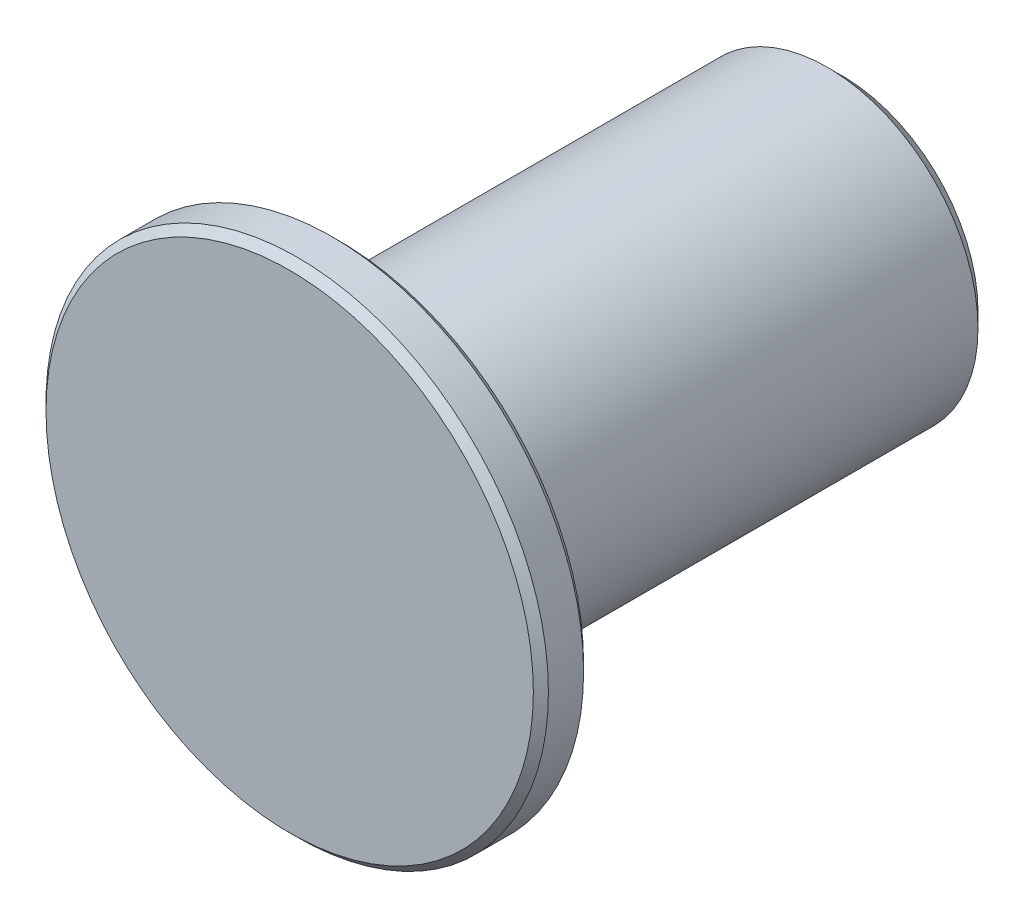
ISO-10303-21;
HEADER;
FILE_DESCRIPTION(('STEP AP214'),'2;1');
FILE_NAME('part.step','',(''),(''),'','','');
FILE_SCHEMA(('AUTOMOTIVE_DESIGN { 1 0 10303 214 1 1 1 1 }'));
ENDSEC;
DATA;
#1=APPLICATION_CONTEXT('core data for automotive mechanical design processes');
#2=APPLICATION_PROTOCOL_DEFINITION('international standard','automotive_design',2000,#1);
#3=PRODUCT_CONTEXT('',#1,'mechanical');
#4=PRODUCT('Part','Part','',(#3));
#5=PRODUCT_RELATED_PRODUCT_CATEGORY('part','',(#4));
#6=PRODUCT_DEFINITION_FORMATION('','',#4);
#7=PRODUCT_DEFINITION_CONTEXT('part definition',#1,'design');
#8=PRODUCT_DEFINITION('design','',#6,#7);
#9=PRODUCT_DEFINITION_SHAPE('','',#8);
#10=(LENGTH_UNIT() NAMED_UNIT(*) SI_UNIT(.MILLI.,.METRE.));
#11=(NAMED_UNIT(*) PLANE_ANGLE_UNIT() SI_UNIT($,.RADIAN.));
#12=(NAMED_UNIT(*) SI_UNIT($,.STERADIAN.) SOLID_ANGLE_UNIT());
#13=UNCERTAINTY_MEASURE_WITH_UNIT(LENGTH_MEASURE(1.E-05),#10,'distance_accuracy_value','');
#14=(GEOMETRIC_REPRESENTATION_CONTEXT(3) GLOBAL_UNCERTAINTY_ASSIGNED_CONTEXT((#13)) GLOBAL_UNIT_ASSIGNED_CONTEXT((#10,
#11,#12)) REPRESENTATION_CONTEXT('',''));
#15=CARTESIAN_POINT('',(0.,0.,0.));
#16=DIRECTION('',(0.,0.,1.));
#17=DIRECTION('',(1.,0.,0.));
#18=AXIS2_PLACEMENT_3D('',#15,#16,#17);
#19=CARTESIAN_POINT('',(0.,0.,20.));
#20=DIRECTION('',(0.,0.,-1.));
#21=DIRECTION('',(-1.,0.,0.));
#22=AXIS2_PLACEMENT_3D('',#19,#20,#21);
#23=CYLINDRICAL_SURFACE('',#22,6.);
#24=CARTESIAN_POINT('',(0.,0.,0.600000000000007));
#25=DIRECTION('',(0.,0.,1.));
#26=DIRECTION('',(1.,0.,0.));
#27=AXIS2_PLACEMENT_3D('',#24,#25,#26);
#28=CIRCLE('',#27,6.);
#29=CARTESIAN_POINT('',(6.,0.,0.600000000000007));
#30=VERTEX_POINT('',#29);
#31=EDGE_CURVE('E65',#30,#30,#28,.T.);
#32=ORIENTED_EDGE('',*,*,#31,.T.);
#33=EDGE_LOOP('',(#32));
#34=FACE_BOUND('',#33,.T.);
#35=CARTESIAN_POINT('',(0.,0.,20.));
#36=DIRECTION('',(0.,0.,1.));
#37=DIRECTION('',(1.,0.,0.));
#38=AXIS2_PLACEMENT_3D('',#35,#36,#37);
#39=CIRCLE('',#38,6.);
#40=CARTESIAN_POINT('',(6.,0.,20.));
#41=VERTEX_POINT('',#40);
#42=EDGE_CURVE('E69',#41,#41,#39,.T.);
#43=ORIENTED_EDGE('',*,*,#42,.F.);
#44=EDGE_LOOP('',(#43));
#45=FACE_BOUND('',#44,.T.);
#46=ADVANCED_FACE('F37',(#34,#45),#23,.T.);
#47=CARTESIAN_POINT('',(0.,0.,0.));
#48=DIRECTION('',(0.,0.,1.));
#49=DIRECTION('',(1.,0.,0.));
#50=AXIS2_PLACEMENT_3D('',#47,#48,#49);
#51=PLANE('',#50);
#52=CARTESIAN_POINT('',(0.,0.,0.));
#53=DIRECTION('',(0.,0.,1.));
#54=DIRECTION('',(1.,0.,0.));
#55=AXIS2_PLACEMENT_3D('',#52,#53,#54);
#56=CIRCLE('',#55,5.39999999999999);
#57=CARTESIAN_POINT('',(5.39999999999999,0.,0.));
#58=VERTEX_POINT('',#57);
#59=EDGE_CURVE('E61',#58,#58,#56,.F.);
#60=ORIENTED_EDGE('',*,*,#59,.T.);
#61=EDGE_LOOP('',(#60));
#62=FACE_BOUND('',#61,.T.);
#63=ADVANCED_FACE('F77',(#62),#51,.F.);
#64=CARTESIAN_POINT('',(0.,0.,22.));
#65=DIRECTION('',(0.,0.,-1.));
#66=DIRECTION('',(-1.,0.,0.));
#67=AXIS2_PLACEMENT_3D('',#64,#65,#66);
#68=CYLINDRICAL_SURFACE('',#67,10.);
#69=CARTESIAN_POINT('',(0.,0.,20.3));
#70=DIRECTION('',(0.,0.,1.));
#71=DIRECTION('',(1.,0.,0.));
#72=AXIS2_PLACEMENT_3D('',#69,#70,#71);
#73=CIRCLE('',#72,10.);
#74=CARTESIAN_POINT('',(10.,0.,20.3));
#75=VERTEX_POINT('',#74);
#76=EDGE_CURVE('E50',#75,#75,#73,.T.);
#77=ORIENTED_EDGE('',*,*,#76,.T.);
#78=EDGE_LOOP('',(#77));
#79=FACE_BOUND('',#78,.T.);
#80=CARTESIAN_POINT('',(0.,0.,21.7));
#81=DIRECTION('',(0.,0.,1.));
#82=DIRECTION('',(1.,0.,0.));
#83=AXIS2_PLACEMENT_3D('',#80,#81,#82);
#84=CIRCLE('',#83,10.);
#85=CARTESIAN_POINT('',(10.,0.,21.7));
#86=VERTEX_POINT('',#85);
#87=EDGE_CURVE('E55',#86,#86,#84,.F.);
#88=ORIENTED_EDGE('',*,*,#87,.T.);
#89=EDGE_LOOP('',(#88));
#90=FACE_BOUND('',#89,.T.);
#91=ADVANCED_FACE('F83',(#79,#90),#68,.T.);
#92=CARTESIAN_POINT('',(0.,0.,22.));
#93=DIRECTION('',(0.,0.,1.));
#94=DIRECTION('',(1.,0.,0.));
#95=AXIS2_PLACEMENT_3D('',#92,#93,#94);
#96=PLANE('',#95);
#97=CARTESIAN_POINT('',(0.,0.,22.));
#98=DIRECTION('',(0.,0.,1.));
#99=DIRECTION('',(1.,0.,0.));
#100=AXIS2_PLACEMENT_3D('',#97,#98,#99);
#101=CIRCLE('',#100,9.7);
#102=CARTESIAN_POINT('',(9.7,0.,22.));
#103=VERTEX_POINT('',#102);
#104=EDGE_CURVE('E10',#103,#103,#101,.T.);
#105=ORIENTED_EDGE('',*,*,#104,.T.);
#106=EDGE_LOOP('',(#105));
#107=FACE_BOUND('',#106,.T.);
#108=ADVANCED_FACE('F103',(#107),#96,.T.);
#109=CARTESIAN_POINT('',(0.,0.,20.));
#110=DIRECTION('',(0.,0.,1.));
#111=DIRECTION('',(1.,0.,0.));
#112=AXIS2_PLACEMENT_3D('',#109,#110,#111);
#113=PLANE('',#112);
#114=CARTESIAN_POINT('',(0.,0.,20.));
#115=DIRECTION('',(0.,0.,1.));
#116=DIRECTION('',(1.,0.,0.));
#117=AXIS2_PLACEMENT_3D('',#114,#115,#116);
#118=CIRCLE('',#117,9.7);
#119=CARTESIAN_POINT('',(9.7,0.,20.));
#120=VERTEX_POINT('',#119);
#121=EDGE_CURVE('E45',#120,#120,#118,.F.);
#122=ORIENTED_EDGE('',*,*,#121,.T.);
#123=EDGE_LOOP('',(#122));
#124=FACE_BOUND('',#123,.T.);
#125=ORIENTED_EDGE('',*,*,#42,.T.);
#126=EDGE_LOOP('',(#125));
#127=FACE_BOUND('',#126,.T.);
#128=ADVANCED_FACE('F74',(#124,#127),#113,.F.);
#129=CARTESIAN_POINT('',(0.,0.,0.600000000000007));
#130=DIRECTION('',(0.,0.,1.));
#131=DIRECTION('',(1.,0.,0.));
#132=AXIS2_PLACEMENT_3D('',#129,#130,#131);
#133=CONICAL_SURFACE('',#132,6.,0.785398163397453);
#134=ORIENTED_EDGE('',*,*,#59,.F.);
#135=EDGE_LOOP('',(#134));
#136=FACE_BOUND('',#135,.T.);
#137=ORIENTED_EDGE('',*,*,#31,.F.);
#138=EDGE_LOOP('',(#137));
#139=FACE_BOUND('',#138,.T.);
#140=ADVANCED_FACE('F88',(#136,#139),#133,.T.);
#141=CARTESIAN_POINT('',(0.,0.,20.3));
#142=DIRECTION('',(0.,0.,1.));
#143=DIRECTION('',(1.,0.,0.));
#144=AXIS2_PLACEMENT_3D('',#141,#142,#143);
#145=CONICAL_SURFACE('',#144,10.,0.78539816339744);
#146=ORIENTED_EDGE('',*,*,#121,.F.);
#147=EDGE_LOOP('',(#146));
#148=FACE_BOUND('',#147,.T.);
#149=ORIENTED_EDGE('',*,*,#76,.F.);
#150=EDGE_LOOP('',(#149));
#151=FACE_BOUND('',#150,.T.);
#152=ADVANCED_FACE('F90',(#148,#151),#145,.T.);
#153=CARTESIAN_POINT('',(0.,0.,22.));
#154=DIRECTION('',(0.,0.,-1.));
#155=DIRECTION('',(-1.,0.,0.));
#156=AXIS2_PLACEMENT_3D('',#153,#154,#155);
#157=CONICAL_SURFACE('',#156,9.7,0.785398163397434);
#158=ORIENTED_EDGE('',*,*,#87,.F.);
#159=EDGE_LOOP('',(#158));
#160=FACE_BOUND('',#159,.T.);
#161=ORIENTED_EDGE('',*,*,#104,.F.);
#162=EDGE_LOOP('',(#161));
#163=FACE_BOUND('',#162,.T.);
#164=ADVANCED_FACE('F39',(#160,#163),#157,.T.);
#165=CLOSED_SHELL('',(#46,#63,#91,#108,#128,#140,#152,#164));
#166=MANIFOLD_SOLID_BREP('B2',#165);
#167=ADVANCED_BREP_SHAPE_REPRESENTATION('',(#18,#166),#14);
#168=SHAPE_DEFINITION_REPRESENTATION(#9,#167);
ENDSEC;
END-ISO-10303-21;
